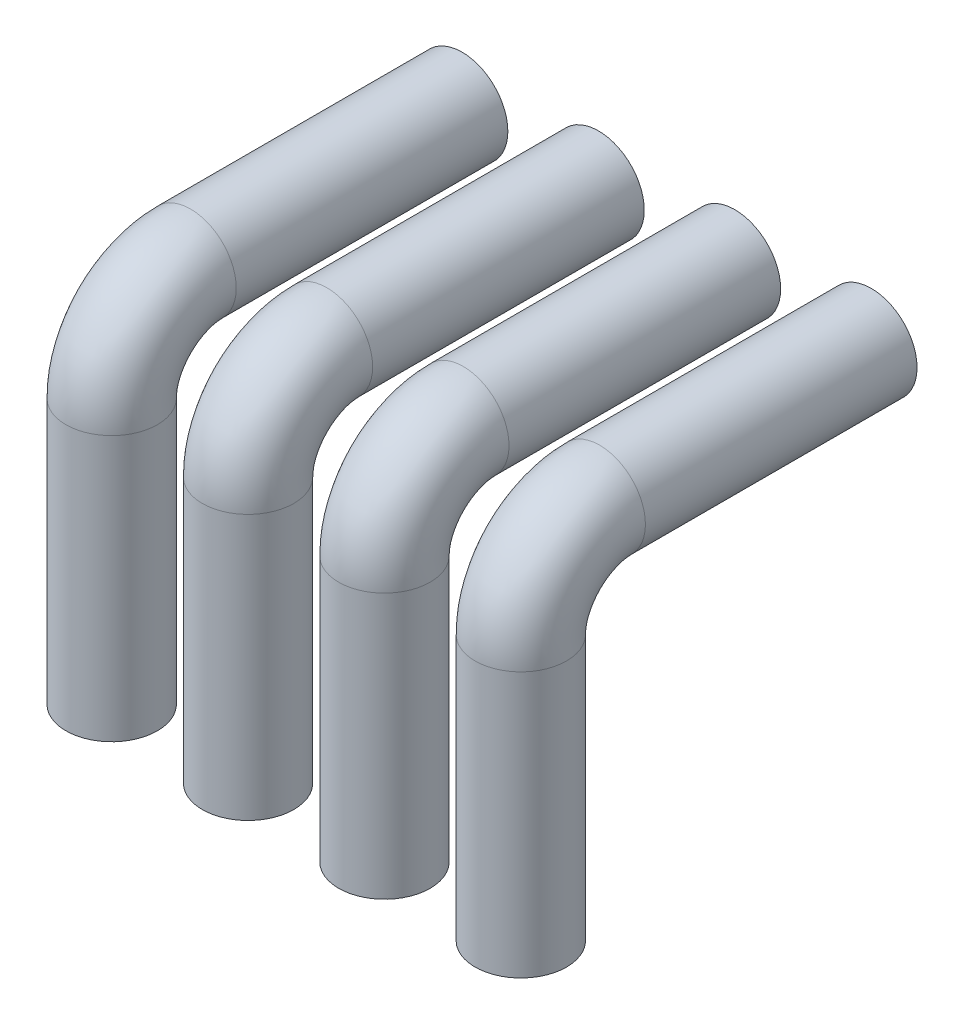
ISO-10303-21;
HEADER;
FILE_DESCRIPTION(('STEP AP214'),'2;1');
FILE_NAME('part.step','',(''),(''),'','','');
FILE_SCHEMA(('AUTOMOTIVE_DESIGN { 1 0 10303 214 1 1 1 1 }'));
ENDSEC;
DATA;
#1=APPLICATION_CONTEXT('core data for automotive mechanical design processes');
#2=APPLICATION_PROTOCOL_DEFINITION('international standard','automotive_design',2000,#1);
#3=PRODUCT_CONTEXT('',#1,'mechanical');
#4=PRODUCT('Part','Part','',(#3));
#5=PRODUCT_RELATED_PRODUCT_CATEGORY('part','',(#4));
#6=PRODUCT_DEFINITION_FORMATION('','',#4);
#7=PRODUCT_DEFINITION_CONTEXT('part definition',#1,'design');
#8=PRODUCT_DEFINITION('design','',#6,#7);
#9=PRODUCT_DEFINITION_SHAPE('','',#8);
#10=(LENGTH_UNIT() NAMED_UNIT(*) SI_UNIT(.MILLI.,.METRE.));
#11=(NAMED_UNIT(*) PLANE_ANGLE_UNIT() SI_UNIT($,.RADIAN.));
#12=(NAMED_UNIT(*) SI_UNIT($,.STERADIAN.) SOLID_ANGLE_UNIT());
#13=UNCERTAINTY_MEASURE_WITH_UNIT(LENGTH_MEASURE(1.E-05),#10,'distance_accuracy_value','');
#14=(GEOMETRIC_REPRESENTATION_CONTEXT(3) GLOBAL_UNCERTAINTY_ASSIGNED_CONTEXT((#13)) GLOBAL_UNIT_ASSIGNED_CONTEXT((#10,
#11,#12)) REPRESENTATION_CONTEXT('',''));
#15=CARTESIAN_POINT('',(0.,0.,0.));
#16=DIRECTION('',(0.,0.,1.));
#17=DIRECTION('',(1.,0.,0.));
#18=AXIS2_PLACEMENT_3D('',#15,#16,#17);
#19=CARTESIAN_POINT('',(60.,24.7351014473264,0.));
#20=DIRECTION('',(0.,0.,1.));
#21=DIRECTION('',(1.,0.,0.));
#22=AXIS2_PLACEMENT_3D('',#19,#20,#21);
#23=PLANE('',#22);
#24=CARTESIAN_POINT('',(60.,24.7351014473264,0.));
#25=DIRECTION('',(0.,0.,1.));
#26=DIRECTION('',(1.,0.,0.));
#27=AXIS2_PLACEMENT_3D('',#24,#25,#26);
#28=CIRCLE('',#27,6.70833426295246);
#29=CARTESIAN_POINT('',(66.7083342629524,24.7351014473264,0.));
#30=VERTEX_POINT('',#29);
#31=EDGE_CURVE('E62',#30,#30,#28,.T.);
#32=ORIENTED_EDGE('',*,*,#31,.F.);
#33=EDGE_LOOP('',(#32));
#34=FACE_BOUND('',#33,.T.);
#35=ADVANCED_FACE('F50',(#34),#23,.F.);
#36=CARTESIAN_POINT('',(60.,-25.7007452908056,51.3893432671571));
#37=DIRECTION('',(0.,-1.,0.));
#38=DIRECTION('',(1.,0.,0.));
#39=AXIS2_PLACEMENT_3D('',#36,#37,#38);
#40=PLANE('',#39);
#41=CARTESIAN_POINT('',(60.,-25.7007452908056,51.3893432671571));
#42=DIRECTION('',(0.,-1.,0.));
#43=DIRECTION('',(1.,0.,0.));
#44=AXIS2_PLACEMENT_3D('',#41,#42,#43);
#45=CIRCLE('',#44,6.70833426295246);
#46=CARTESIAN_POINT('',(66.7083342629524,-25.7007452908056,51.3893432671571));
#47=VERTEX_POINT('',#46);
#48=EDGE_CURVE('E12',#47,#47,#45,.T.);
#49=ORIENTED_EDGE('',*,*,#48,.T.);
#50=EDGE_LOOP('',(#49));
#51=FACE_BOUND('',#50,.T.);
#52=ADVANCED_FACE('F65',(#51),#40,.T.);
#53=CARTESIAN_POINT('',(60.,24.7351014473264,0.));
#54=DIRECTION('',(0.,0.,1.));
#55=DIRECTION('',(1.,0.,0.));
#56=AXIS2_PLACEMENT_3D('',#53,#54,#55);
#57=CYLINDRICAL_SURFACE('',#56,6.70833426295246);
#58=CARTESIAN_POINT('',(60.,24.7351014473264,39.8299735587102));
#59=DIRECTION('',(0.,0.,1.));
#60=DIRECTION('',(1.,0.,0.));
#61=AXIS2_PLACEMENT_3D('',#58,#59,#60);
#62=CIRCLE('',#61,6.70833426295246);
#63=CARTESIAN_POINT('',(60.,31.4434357102789,39.8299735587102));
#64=VERTEX_POINT('',#63);
#65=EDGE_CURVE('E75',#64,#64,#62,.T.);
#66=ORIENTED_EDGE('',*,*,#65,.F.);
#67=EDGE_LOOP('',(#66));
#68=FACE_BOUND('',#67,.T.);
#69=ORIENTED_EDGE('',*,*,#31,.T.);
#70=EDGE_LOOP('',(#69));
#71=FACE_BOUND('',#70,.T.);
#72=ADVANCED_FACE('F80',(#68,#71),#57,.T.);
#73=CARTESIAN_POINT('',(60.,13.1757317388795,39.8299735587102));
#74=DIRECTION('',(1.,0.,0.));
#75=DIRECTION('',(0.,0.,-1.));
#76=AXIS2_PLACEMENT_3D('',#73,#74,#75);
#77=TOROIDAL_SURFACE('',#76,11.5593697084469,6.70833426295246);
#78=CARTESIAN_POINT('',(60.,13.1757317388795,51.3893432671571));
#79=DIRECTION('',(0.,-1.,0.));
#80=DIRECTION('',(1.,0.,0.));
#81=AXIS2_PLACEMENT_3D('',#78,#79,#80);
#82=CIRCLE('',#81,6.70833426295246);
#83=CARTESIAN_POINT('',(60.,13.1757317388795,58.0976775301096));
#84=VERTEX_POINT('',#83);
#85=EDGE_CURVE('E57',#84,#84,#82,.T.);
#86=CARTESIAN_POINT('',(60.,13.1757317388795,39.8299735587102));
#87=DIRECTION('',(1.,0.,0.));
#88=DIRECTION('',(0.,0.,-1.));
#89=AXIS2_PLACEMENT_3D('',#86,#87,#88);
#90=CIRCLE('',#89,18.2677039713994);
#91=EDGE_CURVE('',#64,#84,#90,.T.);
#92=ORIENTED_EDGE('',*,*,#65,.T.);
#93=ORIENTED_EDGE('',*,*,#85,.F.);
#94=ORIENTED_EDGE('',*,*,#91,.T.);
#95=ORIENTED_EDGE('',*,*,#91,.F.);
#96=EDGE_LOOP('',(#92,#94,#93,#95));
#97=FACE_BOUND('',#96,.T.);
#98=ADVANCED_FACE('F70',(#97),#77,.T.);
#99=CARTESIAN_POINT('',(60.,13.1757317388795,51.3893432671571));
#100=DIRECTION('',(0.,-1.,0.));
#101=DIRECTION('',(0.,0.,-1.));
#102=AXIS2_PLACEMENT_3D('',#99,#100,#101);
#103=CYLINDRICAL_SURFACE('',#102,6.70833426295246);
#104=ORIENTED_EDGE('',*,*,#48,.F.);
#105=EDGE_LOOP('',(#104));
#106=FACE_BOUND('',#105,.T.);
#107=ORIENTED_EDGE('',*,*,#85,.T.);
#108=EDGE_LOOP('',(#107));
#109=FACE_BOUND('',#108,.T.);
#110=ADVANCED_FACE('F67',(#106,#109),#103,.T.);
#111=CLOSED_SHELL('',(#35,#52,#72,#98,#110));
#112=MANIFOLD_SOLID_BREP('B2',#111);
#113=CARTESIAN_POINT('',(40.,24.7351014473264,0.));
#114=DIRECTION('',(0.,0.,1.));
#115=DIRECTION('',(1.,0.,0.));
#116=AXIS2_PLACEMENT_3D('',#113,#114,#115);
#117=PLANE('',#116);
#118=CARTESIAN_POINT('',(40.,24.7351014473264,0.));
#119=DIRECTION('',(0.,0.,1.));
#120=DIRECTION('',(1.,0.,0.));
#121=AXIS2_PLACEMENT_3D('',#118,#119,#120);
#122=CIRCLE('',#121,6.70833426295246);
#123=CARTESIAN_POINT('',(46.7083342629525,24.7351014473264,0.));
#124=VERTEX_POINT('',#123);
#125=EDGE_CURVE('E145',#124,#124,#122,.T.);
#126=ORIENTED_EDGE('',*,*,#125,.F.);
#127=EDGE_LOOP('',(#126));
#128=FACE_BOUND('',#127,.T.);
#129=ADVANCED_FACE('F133',(#128),#117,.F.);
#130=CARTESIAN_POINT('',(40.,-25.7007452908056,51.3893432671571));
#131=DIRECTION('',(0.,-1.,0.));
#132=DIRECTION('',(1.,0.,0.));
#133=AXIS2_PLACEMENT_3D('',#130,#131,#132);
#134=PLANE('',#133);
#135=CARTESIAN_POINT('',(40.,-25.7007452908056,51.3893432671571));
#136=DIRECTION('',(0.,-1.,0.));
#137=DIRECTION('',(1.,0.,0.));
#138=AXIS2_PLACEMENT_3D('',#135,#136,#137);
#139=CIRCLE('',#138,6.70833426295246);
#140=CARTESIAN_POINT('',(46.7083342629525,-25.7007452908056,51.3893432671571));
#141=VERTEX_POINT('',#140);
#142=EDGE_CURVE('E48',#141,#141,#139,.T.);
#143=ORIENTED_EDGE('',*,*,#142,.T.);
#144=EDGE_LOOP('',(#143));
#145=FACE_BOUND('',#144,.T.);
#146=ADVANCED_FACE('F148',(#145),#134,.T.);
#147=CARTESIAN_POINT('',(40.,24.7351014473264,0.));
#148=DIRECTION('',(0.,0.,1.));
#149=DIRECTION('',(1.,0.,0.));
#150=AXIS2_PLACEMENT_3D('',#147,#148,#149);
#151=CYLINDRICAL_SURFACE('',#150,6.70833426295246);
#152=CARTESIAN_POINT('',(40.,24.7351014473264,39.8299735587102));
#153=DIRECTION('',(0.,0.,1.));
#154=DIRECTION('',(1.,0.,0.));
#155=AXIS2_PLACEMENT_3D('',#152,#153,#154);
#156=CIRCLE('',#155,6.70833426295246);
#157=CARTESIAN_POINT('',(40.,31.4434357102789,39.8299735587102));
#158=VERTEX_POINT('',#157);
#159=EDGE_CURVE('E158',#158,#158,#156,.T.);
#160=ORIENTED_EDGE('',*,*,#159,.F.);
#161=EDGE_LOOP('',(#160));
#162=FACE_BOUND('',#161,.T.);
#163=ORIENTED_EDGE('',*,*,#125,.T.);
#164=EDGE_LOOP('',(#163));
#165=FACE_BOUND('',#164,.T.);
#166=ADVANCED_FACE('F163',(#162,#165),#151,.T.);
#167=CARTESIAN_POINT('',(40.,13.1757317388795,39.8299735587102));
#168=DIRECTION('',(1.,0.,0.));
#169=DIRECTION('',(0.,0.,-1.));
#170=AXIS2_PLACEMENT_3D('',#167,#168,#169);
#171=TOROIDAL_SURFACE('',#170,11.5593697084469,6.70833426295246);
#172=CARTESIAN_POINT('',(40.,13.1757317388795,51.3893432671571));
#173=DIRECTION('',(0.,-1.,0.));
#174=DIRECTION('',(1.,0.,0.));
#175=AXIS2_PLACEMENT_3D('',#172,#173,#174);
#176=CIRCLE('',#175,6.70833426295246);
#177=CARTESIAN_POINT('',(40.,13.1757317388795,58.0976775301096));
#178=VERTEX_POINT('',#177);
#179=EDGE_CURVE('E140',#178,#178,#176,.T.);
#180=CARTESIAN_POINT('',(40.,13.1757317388795,39.8299735587102));
#181=DIRECTION('',(1.,0.,0.));
#182=DIRECTION('',(0.,0.,-1.));
#183=AXIS2_PLACEMENT_3D('',#180,#181,#182);
#184=CIRCLE('',#183,18.2677039713994);
#185=EDGE_CURVE('',#158,#178,#184,.T.);
#186=ORIENTED_EDGE('',*,*,#159,.T.);
#187=ORIENTED_EDGE('',*,*,#179,.F.);
#188=ORIENTED_EDGE('',*,*,#185,.T.);
#189=ORIENTED_EDGE('',*,*,#185,.F.);
#190=EDGE_LOOP('',(#186,#188,#187,#189));
#191=FACE_BOUND('',#190,.T.);
#192=ADVANCED_FACE('F153',(#191),#171,.T.);
#193=CARTESIAN_POINT('',(40.,13.1757317388795,51.3893432671571));
#194=DIRECTION('',(0.,-1.,0.));
#195=DIRECTION('',(0.,0.,-1.));
#196=AXIS2_PLACEMENT_3D('',#193,#194,#195);
#197=CYLINDRICAL_SURFACE('',#196,6.70833426295246);
#198=ORIENTED_EDGE('',*,*,#142,.F.);
#199=EDGE_LOOP('',(#198));
#200=FACE_BOUND('',#199,.T.);
#201=ORIENTED_EDGE('',*,*,#179,.T.);
#202=EDGE_LOOP('',(#201));
#203=FACE_BOUND('',#202,.T.);
#204=ADVANCED_FACE('F150',(#200,#203),#197,.T.);
#205=CLOSED_SHELL('',(#129,#146,#166,#192,#204));
#206=MANIFOLD_SOLID_BREP('B6',#205);
#207=CARTESIAN_POINT('',(20.,24.7351014473264,0.));
#208=DIRECTION('',(0.,0.,1.));
#209=DIRECTION('',(1.,0.,0.));
#210=AXIS2_PLACEMENT_3D('',#207,#208,#209);
#211=PLANE('',#210);
#212=CARTESIAN_POINT('',(20.,24.7351014473264,0.));
#213=DIRECTION('',(0.,0.,1.));
#214=DIRECTION('',(1.,0.,0.));
#215=AXIS2_PLACEMENT_3D('',#212,#213,#214);
#216=CIRCLE('',#215,6.70833426295246);
#217=CARTESIAN_POINT('',(26.7083342629525,24.7351014473264,0.));
#218=VERTEX_POINT('',#217);
#219=EDGE_CURVE('E228',#218,#218,#216,.T.);
#220=ORIENTED_EDGE('',*,*,#219,.F.);
#221=EDGE_LOOP('',(#220));
#222=FACE_BOUND('',#221,.T.);
#223=ADVANCED_FACE('F215',(#222),#211,.F.);
#224=CARTESIAN_POINT('',(20.,-25.7007452908056,51.3893432671571));
#225=DIRECTION('',(0.,-1.,0.));
#226=DIRECTION('',(1.,0.,0.));
#227=AXIS2_PLACEMENT_3D('',#224,#225,#226);
#228=PLANE('',#227);
#229=CARTESIAN_POINT('',(20.,-25.7007452908056,51.3893432671571));
#230=DIRECTION('',(0.,-1.,0.));
#231=DIRECTION('',(1.,0.,0.));
#232=AXIS2_PLACEMENT_3D('',#229,#230,#231);
#233=CIRCLE('',#232,6.70833426295246);
#234=CARTESIAN_POINT('',(26.7083342629525,-25.7007452908056,51.3893432671571));
#235=VERTEX_POINT('',#234);
#236=EDGE_CURVE('E131',#235,#235,#233,.T.);
#237=ORIENTED_EDGE('',*,*,#236,.T.);
#238=EDGE_LOOP('',(#237));
#239=FACE_BOUND('',#238,.T.);
#240=ADVANCED_FACE('F231',(#239),#228,.T.);
#241=CARTESIAN_POINT('',(20.,24.7351014473264,0.));
#242=DIRECTION('',(0.,0.,1.));
#243=DIRECTION('',(1.,0.,0.));
#244=AXIS2_PLACEMENT_3D('',#241,#242,#243);
#245=CYLINDRICAL_SURFACE('',#244,6.70833426295246);
#246=CARTESIAN_POINT('',(20.,24.7351014473264,39.8299735587102));
#247=DIRECTION('',(0.,0.,1.));
#248=DIRECTION('',(1.,0.,0.));
#249=AXIS2_PLACEMENT_3D('',#246,#247,#248);
#250=CIRCLE('',#249,6.70833426295246);
#251=CARTESIAN_POINT('',(20.,31.4434357102789,39.8299735587102));
#252=VERTEX_POINT('',#251);
#253=EDGE_CURVE('E242',#252,#252,#250,.T.);
#254=ORIENTED_EDGE('',*,*,#253,.F.);
#255=EDGE_LOOP('',(#254));
#256=FACE_BOUND('',#255,.T.);
#257=ORIENTED_EDGE('',*,*,#219,.T.);
#258=EDGE_LOOP('',(#257));
#259=FACE_BOUND('',#258,.T.);
#260=ADVANCED_FACE('F249',(#256,#259),#245,.T.);
#261=CARTESIAN_POINT('',(20.,13.1757317388795,39.8299735587102));
#262=DIRECTION('',(1.,0.,0.));
#263=DIRECTION('',(0.,0.,-1.));
#264=AXIS2_PLACEMENT_3D('',#261,#262,#263);
#265=TOROIDAL_SURFACE('',#264,11.5593697084469,6.70833426295246);
#266=CARTESIAN_POINT('',(20.,13.1757317388795,51.3893432671571));
#267=DIRECTION('',(0.,-1.,0.));
#268=DIRECTION('',(1.,0.,0.));
#269=AXIS2_PLACEMENT_3D('',#266,#267,#268);
#270=CIRCLE('',#269,6.70833426295246);
#271=CARTESIAN_POINT('',(20.,13.1757317388795,58.0976775301096));
#272=VERTEX_POINT('',#271);
#273=EDGE_CURVE('E223',#272,#272,#270,.T.);
#274=CARTESIAN_POINT('',(20.,13.1757317388795,39.8299735587102));
#275=DIRECTION('',(1.,0.,0.));
#276=DIRECTION('',(0.,0.,-1.));
#277=AXIS2_PLACEMENT_3D('',#274,#275,#276);
#278=CIRCLE('',#277,18.2677039713994);
#279=EDGE_CURVE('',#252,#272,#278,.T.);
#280=ORIENTED_EDGE('',*,*,#253,.T.);
#281=ORIENTED_EDGE('',*,*,#273,.F.);
#282=ORIENTED_EDGE('',*,*,#279,.T.);
#283=ORIENTED_EDGE('',*,*,#279,.F.);
#284=EDGE_LOOP('',(#280,#282,#281,#283));
#285=FACE_BOUND('',#284,.T.);
#286=ADVANCED_FACE('F236',(#285),#265,.T.);
#287=CARTESIAN_POINT('',(20.,13.1757317388795,51.3893432671571));
#288=DIRECTION('',(0.,-1.,0.));
#289=DIRECTION('',(0.,0.,-1.));
#290=AXIS2_PLACEMENT_3D('',#287,#288,#289);
#291=CYLINDRICAL_SURFACE('',#290,6.70833426295246);
#292=ORIENTED_EDGE('',*,*,#236,.F.);
#293=EDGE_LOOP('',(#292));
#294=FACE_BOUND('',#293,.T.);
#295=ORIENTED_EDGE('',*,*,#273,.T.);
#296=EDGE_LOOP('',(#295));
#297=FACE_BOUND('',#296,.T.);
#298=ADVANCED_FACE('F233',(#294,#297),#291,.T.);
#299=CLOSED_SHELL('',(#223,#240,#260,#286,#298));
#300=MANIFOLD_SOLID_BREP('B42',#299);
#301=CARTESIAN_POINT('',(0.,24.7351014473264,0.));
#302=DIRECTION('',(0.,0.,1.));
#303=DIRECTION('',(1.,0.,0.));
#304=AXIS2_PLACEMENT_3D('',#301,#302,#303);
#305=PLANE('',#304);
#306=CARTESIAN_POINT('',(0.,24.7351014473264,0.));
#307=DIRECTION('',(0.,0.,1.));
#308=DIRECTION('',(1.,0.,0.));
#309=AXIS2_PLACEMENT_3D('',#306,#307,#308);
#310=CIRCLE('',#309,6.70833426295246);
#311=CARTESIAN_POINT('',(6.70833426295246,24.7351014473264,0.));
#312=VERTEX_POINT('',#311);
#313=EDGE_CURVE('E304',#312,#312,#310,.T.);
#314=ORIENTED_EDGE('',*,*,#313,.F.);
#315=EDGE_LOOP('',(#314));
#316=FACE_BOUND('',#315,.T.);
#317=ADVANCED_FACE('F292',(#316),#305,.F.);
#318=CARTESIAN_POINT('',(0.,-25.7007452908056,51.3893432671571));
#319=DIRECTION('',(0.,-1.,0.));
#320=DIRECTION('',(1.,0.,0.));
#321=AXIS2_PLACEMENT_3D('',#318,#319,#320);
#322=PLANE('',#321);
#323=CARTESIAN_POINT('',(0.,-25.7007452908056,51.3893432671571));
#324=DIRECTION('',(0.,-1.,0.));
#325=DIRECTION('',(1.,0.,0.));
#326=AXIS2_PLACEMENT_3D('',#323,#324,#325);
#327=CIRCLE('',#326,6.70833426295246);
#328=CARTESIAN_POINT('',(6.70833426295246,-25.7007452908056,51.3893432671571));
#329=VERTEX_POINT('',#328);
#330=EDGE_CURVE('E213',#329,#329,#327,.T.);
#331=ORIENTED_EDGE('',*,*,#330,.T.);
#332=EDGE_LOOP('',(#331));
#333=FACE_BOUND('',#332,.T.);
#334=ADVANCED_FACE('F307',(#333),#322,.T.);
#335=CARTESIAN_POINT('',(0.,24.7351014473264,0.));
#336=DIRECTION('',(0.,0.,1.));
#337=DIRECTION('',(1.,0.,0.));
#338=AXIS2_PLACEMENT_3D('',#335,#336,#337);
#339=CYLINDRICAL_SURFACE('',#338,6.70833426295246);
#340=CARTESIAN_POINT('',(0.,24.7351014473264,39.8299735587102));
#341=DIRECTION('',(0.,0.,1.));
#342=DIRECTION('',(1.,0.,0.));
#343=AXIS2_PLACEMENT_3D('',#340,#341,#342);
#344=CIRCLE('',#343,6.70833426295246);
#345=CARTESIAN_POINT('',(0.,31.4434357102789,39.8299735587102));
#346=VERTEX_POINT('',#345);
#347=EDGE_CURVE('E317',#346,#346,#344,.T.);
#348=ORIENTED_EDGE('',*,*,#347,.F.);
#349=EDGE_LOOP('',(#348));
#350=FACE_BOUND('',#349,.T.);
#351=ORIENTED_EDGE('',*,*,#313,.T.);
#352=EDGE_LOOP('',(#351));
#353=FACE_BOUND('',#352,.T.);
#354=ADVANCED_FACE('F322',(#350,#353),#339,.T.);
#355=CARTESIAN_POINT('',(0.,13.1757317388795,39.8299735587102));
#356=DIRECTION('',(1.,0.,0.));
#357=DIRECTION('',(0.,0.,-1.));
#358=AXIS2_PLACEMENT_3D('',#355,#356,#357);
#359=TOROIDAL_SURFACE('',#358,11.5593697084469,6.70833426295246);
#360=CARTESIAN_POINT('',(0.,13.1757317388795,51.3893432671571));
#361=DIRECTION('',(0.,-1.,0.));
#362=DIRECTION('',(1.,0.,0.));
#363=AXIS2_PLACEMENT_3D('',#360,#361,#362);
#364=CIRCLE('',#363,6.70833426295246);
#365=CARTESIAN_POINT('',(0.,13.1757317388795,58.0976775301096));
#366=VERTEX_POINT('',#365);
#367=EDGE_CURVE('E299',#366,#366,#364,.T.);
#368=CARTESIAN_POINT('',(0.,13.1757317388795,39.8299735587102));
#369=DIRECTION('',(1.,0.,0.));
#370=DIRECTION('',(0.,0.,-1.));
#371=AXIS2_PLACEMENT_3D('',#368,#369,#370);
#372=CIRCLE('',#371,18.2677039713994);
#373=EDGE_CURVE('',#346,#366,#372,.T.);
#374=ORIENTED_EDGE('',*,*,#347,.T.);
#375=ORIENTED_EDGE('',*,*,#367,.F.);
#376=ORIENTED_EDGE('',*,*,#373,.T.);
#377=ORIENTED_EDGE('',*,*,#373,.F.);
#378=EDGE_LOOP('',(#374,#376,#375,#377));
#379=FACE_BOUND('',#378,.T.);
#380=ADVANCED_FACE('F312',(#379),#359,.T.);
#381=CARTESIAN_POINT('',(0.,13.1757317388795,51.3893432671571));
#382=DIRECTION('',(0.,-1.,0.));
#383=DIRECTION('',(0.,0.,-1.));
#384=AXIS2_PLACEMENT_3D('',#381,#382,#383);
#385=CYLINDRICAL_SURFACE('',#384,6.70833426295246);
#386=ORIENTED_EDGE('',*,*,#330,.F.);
#387=EDGE_LOOP('',(#386));
#388=FACE_BOUND('',#387,.T.);
#389=ORIENTED_EDGE('',*,*,#367,.T.);
#390=EDGE_LOOP('',(#389));
#391=FACE_BOUND('',#390,.T.);
#392=ADVANCED_FACE('F309',(#388,#391),#385,.T.);
#393=CLOSED_SHELL('',(#317,#334,#354,#380,#392));
#394=MANIFOLD_SOLID_BREP('B125',#393);
#395=ADVANCED_BREP_SHAPE_REPRESENTATION('',(#18,#112,#206,#300,#394),#14);
#396=SHAPE_DEFINITION_REPRESENTATION(#9,#395);
ENDSEC;
END-ISO-10303-21;
